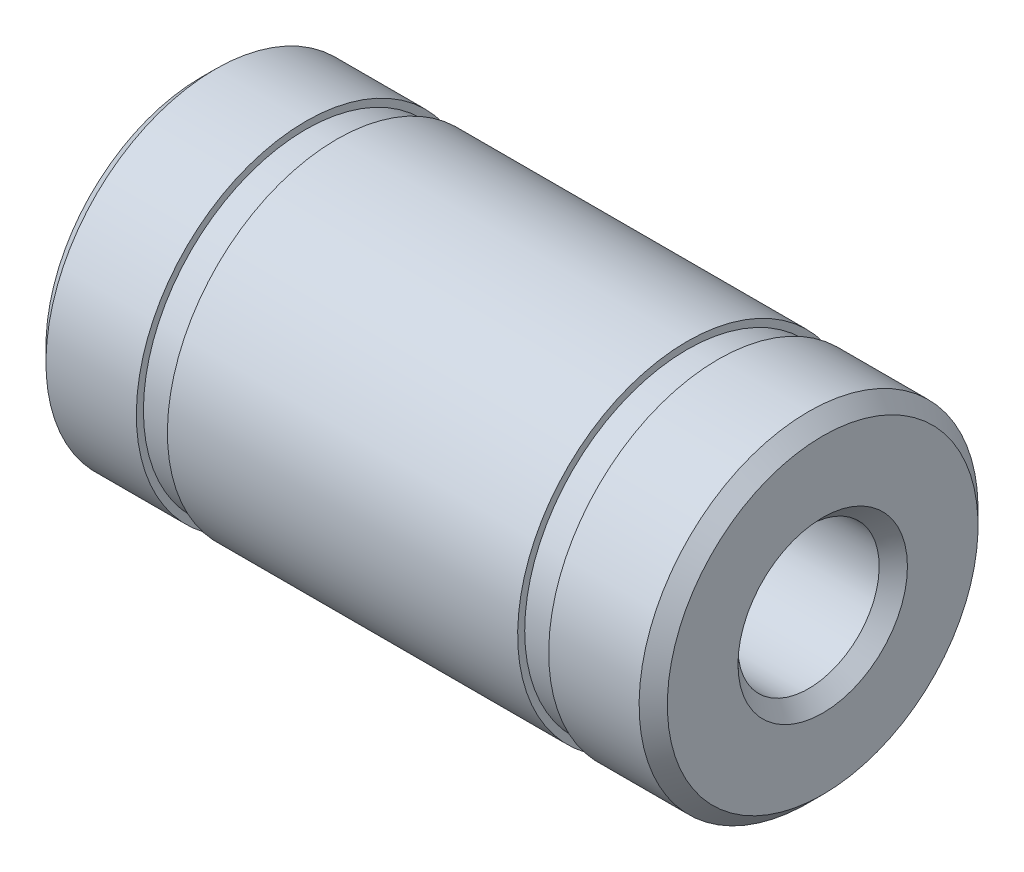
ISO-10303-21;
HEADER;
FILE_DESCRIPTION(('STEP AP214'),'2;1');
FILE_NAME('part.step','',(''),(''),'','','');
FILE_SCHEMA(('AUTOMOTIVE_DESIGN { 1 0 10303 214 1 1 1 1 }'));
ENDSEC;
DATA;
#1=APPLICATION_CONTEXT('core data for automotive mechanical design processes');
#2=APPLICATION_PROTOCOL_DEFINITION('international standard','automotive_design',2000,#1);
#3=PRODUCT_CONTEXT('',#1,'mechanical');
#4=PRODUCT('Part','Part','',(#3));
#5=PRODUCT_RELATED_PRODUCT_CATEGORY('part','',(#4));
#6=PRODUCT_DEFINITION_FORMATION('','',#4);
#7=PRODUCT_DEFINITION_CONTEXT('part definition',#1,'design');
#8=PRODUCT_DEFINITION('design','',#6,#7);
#9=PRODUCT_DEFINITION_SHAPE('','',#8);
#10=(LENGTH_UNIT() NAMED_UNIT(*) SI_UNIT(.MILLI.,.METRE.));
#11=(NAMED_UNIT(*) PLANE_ANGLE_UNIT() SI_UNIT($,.RADIAN.));
#12=(NAMED_UNIT(*) SI_UNIT($,.STERADIAN.) SOLID_ANGLE_UNIT());
#13=UNCERTAINTY_MEASURE_WITH_UNIT(LENGTH_MEASURE(1.E-05),#10,'distance_accuracy_value','');
#14=(GEOMETRIC_REPRESENTATION_CONTEXT(3) GLOBAL_UNCERTAINTY_ASSIGNED_CONTEXT((#13)) GLOBAL_UNIT_ASSIGNED_CONTEXT((#10,
#11,#12)) REPRESENTATION_CONTEXT('',''));
#15=CARTESIAN_POINT('',(0.,0.,0.));
#16=DIRECTION('',(0.,0.,1.));
#17=DIRECTION('',(1.,0.,0.));
#18=AXIS2_PLACEMENT_3D('',#15,#16,#17);
#19=CARTESIAN_POINT('',(18.3,6.,0.));
#20=DIRECTION('',(-1.,0.,0.));
#21=DIRECTION('',(0.,0.,1.));
#22=AXIS2_PLACEMENT_3D('',#19,#20,#21);
#23=PLANE('',#22);
#24=CARTESIAN_POINT('',(18.3,0.,0.));
#25=DIRECTION('',(1.,0.,0.));
#26=DIRECTION('',(0.,0.,-1.));
#27=AXIS2_PLACEMENT_3D('',#24,#25,#26);
#28=CIRCLE('',#27,6.);
#29=CARTESIAN_POINT('',(18.3,6.,0.));
#30=VERTEX_POINT('',#29);
#31=EDGE_CURVE('E106',#30,#30,#28,.T.);
#32=ORIENTED_EDGE('',*,*,#31,.F.);
#33=EDGE_LOOP('',(#32));
#34=FACE_BOUND('',#33,.T.);
#35=CARTESIAN_POINT('',(18.3,0.,0.));
#36=DIRECTION('',(1.,0.,0.));
#37=DIRECTION('',(0.,0.,-1.));
#38=AXIS2_PLACEMENT_3D('',#35,#36,#37);
#39=CIRCLE('',#38,5.75);
#40=CARTESIAN_POINT('',(18.3,5.75,0.));
#41=VERTEX_POINT('',#40);
#42=EDGE_CURVE('E10',#41,#41,#39,.T.);
#43=ORIENTED_EDGE('',*,*,#42,.T.);
#44=EDGE_LOOP('',(#43));
#45=FACE_BOUND('',#44,.T.);
#46=ADVANCED_FACE('F15',(#34,#45),#23,.T.);
#47=CARTESIAN_POINT('',(17.75,0.,0.));
#48=DIRECTION('',(1.,0.,0.));
#49=DIRECTION('',(0.,1.,0.));
#50=AXIS2_PLACEMENT_3D('',#47,#48,#49);
#51=CYLINDRICAL_SURFACE('',#50,5.75);
#52=ORIENTED_EDGE('',*,*,#42,.F.);
#53=EDGE_LOOP('',(#52));
#54=FACE_BOUND('',#53,.T.);
#55=CARTESIAN_POINT('',(17.2,0.,0.));
#56=DIRECTION('',(1.,0.,0.));
#57=DIRECTION('',(0.,0.,-1.));
#58=AXIS2_PLACEMENT_3D('',#55,#56,#57);
#59=CIRCLE('',#58,5.75);
#60=CARTESIAN_POINT('',(17.2,5.75,0.));
#61=VERTEX_POINT('',#60);
#62=EDGE_CURVE('E26',#61,#61,#59,.T.);
#63=ORIENTED_EDGE('',*,*,#62,.T.);
#64=EDGE_LOOP('',(#63));
#65=FACE_BOUND('',#64,.T.);
#66=ADVANCED_FACE('F223',(#54,#65),#51,.T.);
#67=CARTESIAN_POINT('',(17.2,5.75,0.));
#68=DIRECTION('',(1.,0.,0.));
#69=DIRECTION('',(0.,1.,0.));
#70=AXIS2_PLACEMENT_3D('',#67,#68,#69);
#71=PLANE('',#70);
#72=ORIENTED_EDGE('',*,*,#62,.F.);
#73=EDGE_LOOP('',(#72));
#74=FACE_BOUND('',#73,.T.);
#75=CARTESIAN_POINT('',(17.2,0.,0.));
#76=DIRECTION('',(1.,0.,0.));
#77=DIRECTION('',(0.,0.,-1.));
#78=AXIS2_PLACEMENT_3D('',#75,#76,#77);
#79=CIRCLE('',#78,6.);
#80=CARTESIAN_POINT('',(17.2,6.,0.));
#81=VERTEX_POINT('',#80);
#82=EDGE_CURVE('E73',#81,#81,#79,.T.);
#83=ORIENTED_EDGE('',*,*,#82,.T.);
#84=EDGE_LOOP('',(#83));
#85=FACE_BOUND('',#84,.T.);
#86=ADVANCED_FACE('F218',(#74,#85),#71,.T.);
#87=CARTESIAN_POINT('',(11.,0.,0.));
#88=DIRECTION('',(1.,0.,0.));
#89=DIRECTION('',(0.,1.,0.));
#90=AXIS2_PLACEMENT_3D('',#87,#88,#89);
#91=CYLINDRICAL_SURFACE('',#90,6.);
#92=ORIENTED_EDGE('',*,*,#82,.F.);
#93=EDGE_LOOP('',(#92));
#94=FACE_BOUND('',#93,.T.);
#95=CARTESIAN_POINT('',(4.8,0.,0.));
#96=DIRECTION('',(1.,0.,0.));
#97=DIRECTION('',(0.,0.,-1.));
#98=AXIS2_PLACEMENT_3D('',#95,#96,#97);
#99=CIRCLE('',#98,6.);
#100=CARTESIAN_POINT('',(4.8,6.,0.));
#101=VERTEX_POINT('',#100);
#102=EDGE_CURVE('E81',#101,#101,#99,.T.);
#103=ORIENTED_EDGE('',*,*,#102,.T.);
#104=EDGE_LOOP('',(#103));
#105=FACE_BOUND('',#104,.T.);
#106=ADVANCED_FACE('F17',(#94,#105),#91,.T.);
#107=CARTESIAN_POINT('',(4.8,6.,0.));
#108=DIRECTION('',(-1.,0.,0.));
#109=DIRECTION('',(0.,0.,1.));
#110=AXIS2_PLACEMENT_3D('',#107,#108,#109);
#111=PLANE('',#110);
#112=ORIENTED_EDGE('',*,*,#102,.F.);
#113=EDGE_LOOP('',(#112));
#114=FACE_BOUND('',#113,.T.);
#115=CARTESIAN_POINT('',(4.8,0.,0.));
#116=DIRECTION('',(1.,0.,0.));
#117=DIRECTION('',(0.,0.,-1.));
#118=AXIS2_PLACEMENT_3D('',#115,#116,#117);
#119=CIRCLE('',#118,5.75);
#120=CARTESIAN_POINT('',(4.8,5.75,0.));
#121=VERTEX_POINT('',#120);
#122=EDGE_CURVE('E105',#121,#121,#119,.T.);
#123=ORIENTED_EDGE('',*,*,#122,.T.);
#124=EDGE_LOOP('',(#123));
#125=FACE_BOUND('',#124,.T.);
#126=ADVANCED_FACE('F237',(#114,#125),#111,.T.);
#127=CARTESIAN_POINT('',(4.25,0.,0.));
#128=DIRECTION('',(1.,0.,0.));
#129=DIRECTION('',(0.,1.,0.));
#130=AXIS2_PLACEMENT_3D('',#127,#128,#129);
#131=CYLINDRICAL_SURFACE('',#130,5.75);
#132=ORIENTED_EDGE('',*,*,#122,.F.);
#133=EDGE_LOOP('',(#132));
#134=FACE_BOUND('',#133,.T.);
#135=CARTESIAN_POINT('',(3.7,0.,0.));
#136=DIRECTION('',(1.,0.,0.));
#137=DIRECTION('',(0.,0.,-1.));
#138=AXIS2_PLACEMENT_3D('',#135,#136,#137);
#139=CIRCLE('',#138,5.75);
#140=CARTESIAN_POINT('',(3.7,5.75,0.));
#141=VERTEX_POINT('',#140);
#142=EDGE_CURVE('E101',#141,#141,#139,.T.);
#143=ORIENTED_EDGE('',*,*,#142,.T.);
#144=EDGE_LOOP('',(#143));
#145=FACE_BOUND('',#144,.T.);
#146=ADVANCED_FACE('F102',(#134,#145),#131,.T.);
#147=CARTESIAN_POINT('',(3.7,5.75,0.));
#148=DIRECTION('',(1.,0.,0.));
#149=DIRECTION('',(0.,1.,0.));
#150=AXIS2_PLACEMENT_3D('',#147,#148,#149);
#151=PLANE('',#150);
#152=ORIENTED_EDGE('',*,*,#142,.F.);
#153=EDGE_LOOP('',(#152));
#154=FACE_BOUND('',#153,.T.);
#155=CARTESIAN_POINT('',(3.7,0.,0.));
#156=DIRECTION('',(1.,0.,0.));
#157=DIRECTION('',(0.,0.,-1.));
#158=AXIS2_PLACEMENT_3D('',#155,#156,#157);
#159=CIRCLE('',#158,6.);
#160=CARTESIAN_POINT('',(3.7,6.,0.));
#161=VERTEX_POINT('',#160);
#162=EDGE_CURVE('E130',#161,#161,#159,.T.);
#163=ORIENTED_EDGE('',*,*,#162,.T.);
#164=EDGE_LOOP('',(#163));
#165=FACE_BOUND('',#164,.T.);
#166=ADVANCED_FACE('F236',(#154,#165),#151,.T.);
#167=CARTESIAN_POINT('',(20.15,0.,0.));
#168=DIRECTION('',(1.,0.,0.));
#169=DIRECTION('',(0.,1.,0.));
#170=AXIS2_PLACEMENT_3D('',#167,#168,#169);
#171=CYLINDRICAL_SURFACE('',#170,6.);
#172=CARTESIAN_POINT('',(21.5,0.,0.));
#173=DIRECTION('',(1.,0.,0.));
#174=DIRECTION('',(0.,-1.,0.));
#175=AXIS2_PLACEMENT_3D('',#172,#173,#174);
#176=CIRCLE('',#175,6.);
#177=CARTESIAN_POINT('',(21.5,6.,0.));
#178=VERTEX_POINT('',#177);
#179=EDGE_CURVE('E114',#178,#178,#176,.T.);
#180=ORIENTED_EDGE('',*,*,#179,.F.);
#181=EDGE_LOOP('',(#180));
#182=FACE_BOUND('',#181,.T.);
#183=ORIENTED_EDGE('',*,*,#31,.T.);
#184=EDGE_LOOP('',(#183));
#185=FACE_BOUND('',#184,.T.);
#186=ADVANCED_FACE('F303',(#182,#185),#171,.T.);
#187=CARTESIAN_POINT('',(21.75,0.,0.));
#188=DIRECTION('',(-1.,0.,0.));
#189=DIRECTION('',(0.,-1.,0.));
#190=AXIS2_PLACEMENT_3D('',#187,#188,#189);
#191=CONICAL_SURFACE('',#190,5.75,0.785398163400002);
#192=CARTESIAN_POINT('',(22.,0.,0.));
#193=DIRECTION('',(-1.,0.,0.));
#194=DIRECTION('',(0.,-1.,0.));
#195=AXIS2_PLACEMENT_3D('',#192,#193,#194);
#196=CIRCLE('',#195,5.5);
#197=CARTESIAN_POINT('',(22.,5.5,0.));
#198=VERTEX_POINT('',#197);
#199=EDGE_CURVE('E126',#198,#198,#196,.T.);
#200=ORIENTED_EDGE('',*,*,#199,.T.);
#201=EDGE_LOOP('',(#200));
#202=FACE_BOUND('',#201,.T.);
#203=ORIENTED_EDGE('',*,*,#179,.T.);
#204=EDGE_LOOP('',(#203));
#205=FACE_BOUND('',#204,.T.);
#206=ADVANCED_FACE('F292',(#202,#205),#191,.T.);
#207=CARTESIAN_POINT('',(1.85,0.,0.));
#208=DIRECTION('',(1.,0.,0.));
#209=DIRECTION('',(0.,1.,0.));
#210=AXIS2_PLACEMENT_3D('',#207,#208,#209);
#211=CYLINDRICAL_SURFACE('',#210,6.);
#212=CARTESIAN_POINT('',(0.5,0.,0.));
#213=DIRECTION('',(-1.,0.,0.));
#214=DIRECTION('',(0.,-1.,0.));
#215=AXIS2_PLACEMENT_3D('',#212,#213,#214);
#216=CIRCLE('',#215,6.);
#217=CARTESIAN_POINT('',(0.5,6.,0.));
#218=VERTEX_POINT('',#217);
#219=EDGE_CURVE('E127',#218,#218,#216,.T.);
#220=ORIENTED_EDGE('',*,*,#219,.F.);
#221=EDGE_LOOP('',(#220));
#222=FACE_BOUND('',#221,.T.);
#223=ORIENTED_EDGE('',*,*,#162,.F.);
#224=EDGE_LOOP('',(#223));
#225=FACE_BOUND('',#224,.T.);
#226=ADVANCED_FACE('F287',(#222,#225),#211,.T.);
#227=CARTESIAN_POINT('',(0.25,0.,0.));
#228=DIRECTION('',(1.,0.,0.));
#229=DIRECTION('',(0.,-1.,0.));
#230=AXIS2_PLACEMENT_3D('',#227,#228,#229);
#231=CONICAL_SURFACE('',#230,5.75,0.785398163400002);
#232=ORIENTED_EDGE('',*,*,#219,.T.);
#233=EDGE_LOOP('',(#232));
#234=FACE_BOUND('',#233,.T.);
#235=CARTESIAN_POINT('',(0.,0.,0.));
#236=DIRECTION('',(1.,0.,0.));
#237=DIRECTION('',(0.,-1.,0.));
#238=AXIS2_PLACEMENT_3D('',#235,#236,#237);
#239=CIRCLE('',#238,5.5);
#240=CARTESIAN_POINT('',(0.,5.5,0.));
#241=VERTEX_POINT('',#240);
#242=EDGE_CURVE('E19',#241,#241,#239,.T.);
#243=ORIENTED_EDGE('',*,*,#242,.T.);
#244=EDGE_LOOP('',(#243));
#245=FACE_BOUND('',#244,.T.);
#246=ADVANCED_FACE('F279',(#234,#245),#231,.T.);
#247=CARTESIAN_POINT('',(22.,2.5,0.));
#248=DIRECTION('',(1.,0.,0.));
#249=DIRECTION('',(0.,1.,0.));
#250=AXIS2_PLACEMENT_3D('',#247,#248,#249);
#251=PLANE('',#250);
#252=CARTESIAN_POINT('',(22.,0.,0.));
#253=DIRECTION('',(1.,0.,0.));
#254=DIRECTION('',(0.,-1.,0.));
#255=AXIS2_PLACEMENT_3D('',#252,#253,#254);
#256=CIRCLE('',#255,3.);
#257=CARTESIAN_POINT('',(22.,3.,0.));
#258=VERTEX_POINT('',#257);
#259=EDGE_CURVE('E123',#258,#258,#256,.T.);
#260=ORIENTED_EDGE('',*,*,#259,.F.);
#261=EDGE_LOOP('',(#260));
#262=FACE_BOUND('',#261,.T.);
#263=ORIENTED_EDGE('',*,*,#199,.F.);
#264=EDGE_LOOP('',(#263));
#265=FACE_BOUND('',#264,.T.);
#266=ADVANCED_FACE('F269',(#262,#265),#251,.T.);
#267=CARTESIAN_POINT('',(21.75,0.,0.));
#268=DIRECTION('',(1.,0.,0.));
#269=DIRECTION('',(0.,-1.,0.));
#270=AXIS2_PLACEMENT_3D('',#267,#268,#269);
#271=CONICAL_SURFACE('',#270,2.75,0.785398163400002);
#272=CARTESIAN_POINT('',(21.5,0.,0.));
#273=DIRECTION('',(-1.,0.,0.));
#274=DIRECTION('',(0.,-1.,0.));
#275=AXIS2_PLACEMENT_3D('',#272,#273,#274);
#276=CIRCLE('',#275,2.5);
#277=CARTESIAN_POINT('',(21.5,2.5,0.));
#278=VERTEX_POINT('',#277);
#279=EDGE_CURVE('E132',#278,#278,#276,.T.);
#280=ORIENTED_EDGE('',*,*,#279,.T.);
#281=EDGE_LOOP('',(#280));
#282=FACE_BOUND('',#281,.T.);
#283=ORIENTED_EDGE('',*,*,#259,.T.);
#284=EDGE_LOOP('',(#283));
#285=FACE_BOUND('',#284,.T.);
#286=ADVANCED_FACE('F258',(#282,#285),#271,.F.);
#287=CARTESIAN_POINT('',(0.,6.,0.));
#288=DIRECTION('',(-1.,0.,0.));
#289=DIRECTION('',(0.,0.,1.));
#290=AXIS2_PLACEMENT_3D('',#287,#288,#289);
#291=PLANE('',#290);
#292=CARTESIAN_POINT('',(0.,0.,0.));
#293=DIRECTION('',(-1.,0.,0.));
#294=DIRECTION('',(0.,-1.,0.));
#295=AXIS2_PLACEMENT_3D('',#292,#293,#294);
#296=CIRCLE('',#295,3.);
#297=CARTESIAN_POINT('',(0.,3.,0.));
#298=VERTEX_POINT('',#297);
#299=EDGE_CURVE('E122',#298,#298,#296,.T.);
#300=ORIENTED_EDGE('',*,*,#299,.F.);
#301=EDGE_LOOP('',(#300));
#302=FACE_BOUND('',#301,.T.);
#303=ORIENTED_EDGE('',*,*,#242,.F.);
#304=EDGE_LOOP('',(#303));
#305=FACE_BOUND('',#304,.T.);
#306=ADVANCED_FACE('F200',(#302,#305),#291,.T.);
#307=CARTESIAN_POINT('',(11.,0.,0.));
#308=DIRECTION('',(1.,0.,0.));
#309=DIRECTION('',(0.,1.,0.));
#310=AXIS2_PLACEMENT_3D('',#307,#308,#309);
#311=CYLINDRICAL_SURFACE('',#310,2.5);
#312=CARTESIAN_POINT('',(0.5,0.,0.));
#313=DIRECTION('',(1.,0.,0.));
#314=DIRECTION('',(0.,-1.,0.));
#315=AXIS2_PLACEMENT_3D('',#312,#313,#314);
#316=CIRCLE('',#315,2.5);
#317=CARTESIAN_POINT('',(0.5,2.5,0.));
#318=VERTEX_POINT('',#317);
#319=EDGE_CURVE('E119',#318,#318,#316,.T.);
#320=ORIENTED_EDGE('',*,*,#319,.F.);
#321=EDGE_LOOP('',(#320));
#322=FACE_BOUND('',#321,.T.);
#323=ORIENTED_EDGE('',*,*,#279,.F.);
#324=EDGE_LOOP('',(#323));
#325=FACE_BOUND('',#324,.T.);
#326=ADVANCED_FACE('F193',(#322,#325),#311,.F.);
#327=CARTESIAN_POINT('',(0.25,0.,0.));
#328=DIRECTION('',(-1.,0.,0.));
#329=DIRECTION('',(0.,-1.,0.));
#330=AXIS2_PLACEMENT_3D('',#327,#328,#329);
#331=CONICAL_SURFACE('',#330,2.75,0.7853981634);
#332=ORIENTED_EDGE('',*,*,#299,.T.);
#333=EDGE_LOOP('',(#332));
#334=FACE_BOUND('',#333,.T.);
#335=ORIENTED_EDGE('',*,*,#319,.T.);
#336=EDGE_LOOP('',(#335));
#337=FACE_BOUND('',#336,.T.);
#338=ADVANCED_FACE('F199',(#334,#337),#331,.F.);
#339=CLOSED_SHELL('',(#46,#66,#86,#106,#126,#146,#166,#186,#206,#226,#246,#266,#286,#306,#326,#338));
#340=MANIFOLD_SOLID_BREP('B1',#339);
#341=ADVANCED_BREP_SHAPE_REPRESENTATION('',(#18,#340),#14);
#342=SHAPE_DEFINITION_REPRESENTATION(#9,#341);
ENDSEC;
END-ISO-10303-21;
